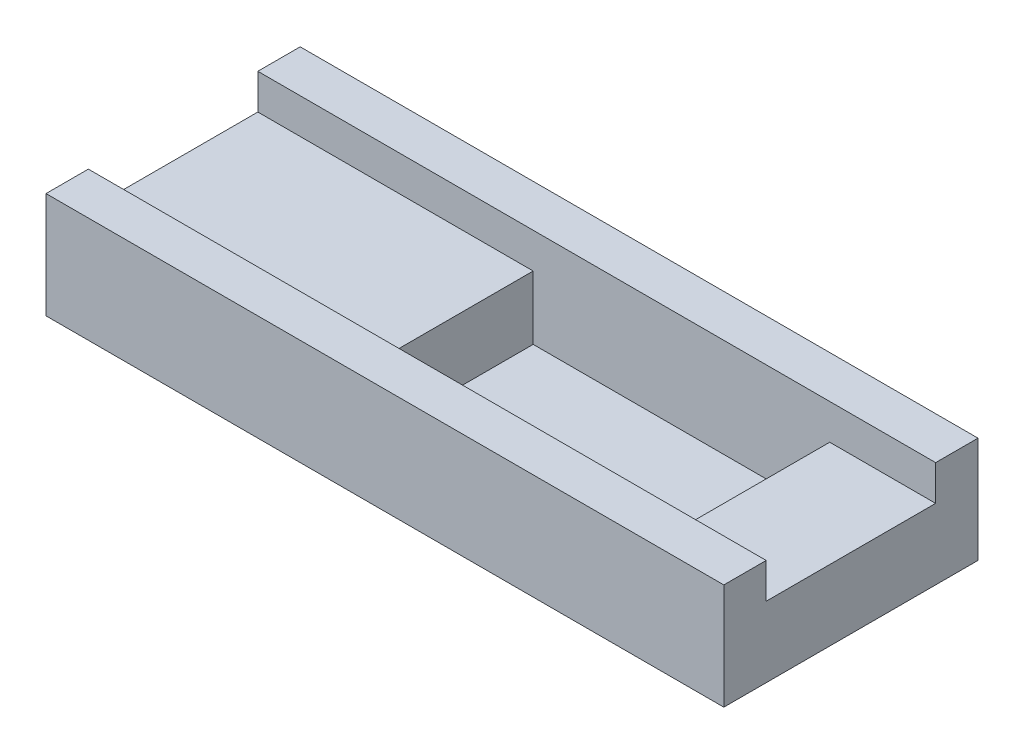
ISO-10303-21;
HEADER;
FILE_DESCRIPTION(('STEP AP214'),'2;1');
FILE_NAME('part.step','',(''),(''),'','','');
FILE_SCHEMA(('AUTOMOTIVE_DESIGN { 1 0 10303 214 1 1 1 1 }'));
ENDSEC;
DATA;
#1=APPLICATION_CONTEXT('core data for automotive mechanical design processes');
#2=APPLICATION_PROTOCOL_DEFINITION('international standard','automotive_design',2000,#1);
#3=PRODUCT_CONTEXT('',#1,'mechanical');
#4=PRODUCT('Part','Part','',(#3));
#5=PRODUCT_RELATED_PRODUCT_CATEGORY('part','',(#4));
#6=PRODUCT_DEFINITION_FORMATION('','',#4);
#7=PRODUCT_DEFINITION_CONTEXT('part definition',#1,'design');
#8=PRODUCT_DEFINITION('design','',#6,#7);
#9=PRODUCT_DEFINITION_SHAPE('','',#8);
#10=(LENGTH_UNIT() NAMED_UNIT(*) SI_UNIT(.MILLI.,.METRE.));
#11=(NAMED_UNIT(*) PLANE_ANGLE_UNIT() SI_UNIT($,.RADIAN.));
#12=(NAMED_UNIT(*) SI_UNIT($,.STERADIAN.) SOLID_ANGLE_UNIT());
#13=UNCERTAINTY_MEASURE_WITH_UNIT(LENGTH_MEASURE(1.E-05),#10,'distance_accuracy_value','');
#14=(GEOMETRIC_REPRESENTATION_CONTEXT(3) GLOBAL_UNCERTAINTY_ASSIGNED_CONTEXT((#13)) GLOBAL_UNIT_ASSIGNED_CONTEXT((#10,
#11,#12)) REPRESENTATION_CONTEXT('',''));
#15=CARTESIAN_POINT('',(0.,0.,0.));
#16=DIRECTION('',(0.,0.,1.));
#17=DIRECTION('',(1.,0.,0.));
#18=AXIS2_PLACEMENT_3D('',#15,#16,#17);
#19=CARTESIAN_POINT('',(0.,-5.,0.));
#20=DIRECTION('',(0.,-1.,0.));
#21=DIRECTION('',(0.,0.,-1.));
#22=AXIS2_PLACEMENT_3D('',#19,#20,#21);
#23=PLANE('',#22);
#24=DIRECTION('',(-1.,0.,0.));
#25=VECTOR('',#24,1.);
#26=CARTESIAN_POINT('',(0.,-5.,-12.));
#27=LINE('',#26,#25);
#28=CARTESIAN_POINT('',(96.,-5.,-12.));
#29=VERTEX_POINT('',#28);
#30=CARTESIAN_POINT('',(81.,-5.,-12.));
#31=VERTEX_POINT('',#30);
#32=EDGE_CURVE('E166',#29,#31,#27,.T.);
#33=ORIENTED_EDGE('',*,*,#32,.T.);
#34=DIRECTION('',(0.,0.,1.));
#35=VECTOR('',#34,1.);
#36=CARTESIAN_POINT('',(81.,-5.,0.));
#37=LINE('',#36,#35);
#38=CARTESIAN_POINT('',(81.,-5.,12.));
#39=VERTEX_POINT('',#38);
#40=EDGE_CURVE('E12',#31,#39,#37,.T.);
#41=ORIENTED_EDGE('',*,*,#40,.T.);
#42=DIRECTION('',(1.,0.,0.));
#43=VECTOR('',#42,1.);
#44=CARTESIAN_POINT('',(0.,-5.,12.));
#45=LINE('',#44,#43);
#46=CARTESIAN_POINT('',(96.,-5.,12.));
#47=VERTEX_POINT('',#46);
#48=EDGE_CURVE('E141',#39,#47,#45,.T.);
#49=ORIENTED_EDGE('',*,*,#48,.T.);
#50=DIRECTION('',(0.,0.,-1.));
#51=VECTOR('',#50,1.);
#52=CARTESIAN_POINT('',(96.,-5.,12.));
#53=LINE('',#52,#51);
#54=EDGE_CURVE('E163',#47,#29,#53,.T.);
#55=ORIENTED_EDGE('',*,*,#54,.T.);
#56=EDGE_LOOP('',(#33,#41,#49,#55));
#57=FACE_BOUND('',#56,.T.);
#58=ADVANCED_FACE('F36',(#57),#23,.F.);
#59=CARTESIAN_POINT('',(0.,0.,0.));
#60=DIRECTION('',(0.,-1.,0.));
#61=DIRECTION('',(0.,0.,-1.));
#62=AXIS2_PLACEMENT_3D('',#59,#60,#61);
#63=PLANE('',#62);
#64=DIRECTION('',(0.,0.,1.));
#65=VECTOR('',#64,1.);
#66=CARTESIAN_POINT('',(0.,0.,18.));
#67=LINE('',#66,#65);
#68=CARTESIAN_POINT('',(0.,0.,-18.));
#69=VERTEX_POINT('',#68);
#70=CARTESIAN_POINT('',(0.,0.,-12.));
#71=VERTEX_POINT('',#70);
#72=EDGE_CURVE('E195',#69,#71,#67,.T.);
#73=ORIENTED_EDGE('',*,*,#72,.T.);
#74=DIRECTION('',(-1.,0.,0.));
#75=VECTOR('',#74,1.);
#76=CARTESIAN_POINT('',(0.,0.,-12.));
#77=LINE('',#76,#75);
#78=CARTESIAN_POINT('',(96.,0.,-12.));
#79=VERTEX_POINT('',#78);
#80=EDGE_CURVE('E159',#79,#71,#77,.T.);
#81=ORIENTED_EDGE('',*,*,#80,.F.);
#82=DIRECTION('',(0.,0.,-1.));
#83=VECTOR('',#82,1.);
#84=CARTESIAN_POINT('',(96.,0.,18.));
#85=LINE('',#84,#83);
#86=CARTESIAN_POINT('',(96.,0.,-18.));
#87=VERTEX_POINT('',#86);
#88=EDGE_CURVE('E201',#79,#87,#85,.T.);
#89=ORIENTED_EDGE('',*,*,#88,.T.);
#90=DIRECTION('',(-1.,0.,0.));
#91=VECTOR('',#90,1.);
#92=CARTESIAN_POINT('',(0.,0.,-18.));
#93=LINE('',#92,#91);
#94=EDGE_CURVE('E185',#87,#69,#93,.T.);
#95=ORIENTED_EDGE('',*,*,#94,.T.);
#96=EDGE_LOOP('',(#73,#81,#89,#95));
#97=FACE_BOUND('',#96,.T.);
#98=ADVANCED_FACE('F238',(#97),#63,.F.);
#99=CARTESIAN_POINT('',(0.,-15.,18.));
#100=DIRECTION('',(-1.,0.,0.));
#101=DIRECTION('',(0.,0.,1.));
#102=AXIS2_PLACEMENT_3D('',#99,#100,#101);
#103=PLANE('',#102);
#104=DIRECTION('',(0.,1.,0.));
#105=VECTOR('',#104,1.);
#106=CARTESIAN_POINT('',(0.,-5.,-12.));
#107=LINE('',#106,#105);
#108=CARTESIAN_POINT('',(0.,-5.,-12.));
#109=VERTEX_POINT('',#108);
#110=EDGE_CURVE('E171',#109,#71,#107,.T.);
#111=ORIENTED_EDGE('',*,*,#110,.T.);
#112=ORIENTED_EDGE('',*,*,#72,.F.);
#113=DIRECTION('',(0.,1.,0.));
#114=VECTOR('',#113,1.);
#115=CARTESIAN_POINT('',(0.,-15.,-18.));
#116=LINE('',#115,#114);
#117=CARTESIAN_POINT('',(0.,-15.,-18.));
#118=VERTEX_POINT('',#117);
#119=EDGE_CURVE('E207',#118,#69,#116,.T.);
#120=ORIENTED_EDGE('',*,*,#119,.F.);
#121=DIRECTION('',(0.,0.,1.));
#122=VECTOR('',#121,1.);
#123=CARTESIAN_POINT('',(0.,-15.,18.));
#124=LINE('',#123,#122);
#125=CARTESIAN_POINT('',(0.,-15.,18.));
#126=VERTEX_POINT('',#125);
#127=EDGE_CURVE('E181',#118,#126,#124,.T.);
#128=ORIENTED_EDGE('',*,*,#127,.T.);
#129=DIRECTION('',(0.,1.,0.));
#130=VECTOR('',#129,1.);
#131=CARTESIAN_POINT('',(0.,-15.,18.));
#132=LINE('',#131,#130);
#133=CARTESIAN_POINT('',(0.,0.,18.));
#134=VERTEX_POINT('',#133);
#135=EDGE_CURVE('E194',#126,#134,#132,.T.);
#136=ORIENTED_EDGE('',*,*,#135,.T.);
#137=CARTESIAN_POINT('',(0.,0.,12.));
#138=VERTEX_POINT('',#137);
#139=EDGE_CURVE('E174',#138,#134,#67,.T.);
#140=ORIENTED_EDGE('',*,*,#139,.F.);
#141=DIRECTION('',(0.,1.,0.));
#142=VECTOR('',#141,1.);
#143=CARTESIAN_POINT('',(0.,-5.,12.));
#144=LINE('',#143,#142);
#145=CARTESIAN_POINT('',(0.,-5.,12.));
#146=VERTEX_POINT('',#145);
#147=EDGE_CURVE('E59',#146,#138,#144,.T.);
#148=ORIENTED_EDGE('',*,*,#147,.F.);
#149=DIRECTION('',(0.,0.,1.));
#150=VECTOR('',#149,1.);
#151=CARTESIAN_POINT('',(0.,-5.,12.));
#152=LINE('',#151,#150);
#153=EDGE_CURVE('E156',#109,#146,#152,.T.);
#154=ORIENTED_EDGE('',*,*,#153,.F.);
#155=EDGE_LOOP('',(#111,#112,#120,#128,#136,#140,#148,#154));
#156=FACE_BOUND('',#155,.T.);
#157=ADVANCED_FACE('F38',(#156),#103,.T.);
#158=CARTESIAN_POINT('',(0.,-15.,-18.));
#159=DIRECTION('',(0.,0.,-1.));
#160=DIRECTION('',(-1.,0.,0.));
#161=AXIS2_PLACEMENT_3D('',#158,#159,#160);
#162=PLANE('',#161);
#163=ORIENTED_EDGE('',*,*,#94,.F.);
#164=DIRECTION('',(0.,1.,0.));
#165=VECTOR('',#164,1.);
#166=CARTESIAN_POINT('',(96.,-15.,-18.));
#167=LINE('',#166,#165);
#168=CARTESIAN_POINT('',(96.,-15.,-18.));
#169=VERTEX_POINT('',#168);
#170=EDGE_CURVE('E209',#169,#87,#167,.T.);
#171=ORIENTED_EDGE('',*,*,#170,.F.);
#172=DIRECTION('',(-1.,0.,0.));
#173=VECTOR('',#172,1.);
#174=CARTESIAN_POINT('',(0.,-15.,-18.));
#175=LINE('',#174,#173);
#176=EDGE_CURVE('E191',#169,#118,#175,.T.);
#177=ORIENTED_EDGE('',*,*,#176,.T.);
#178=ORIENTED_EDGE('',*,*,#119,.T.);
#179=EDGE_LOOP('',(#163,#171,#177,#178));
#180=FACE_BOUND('',#179,.T.);
#181=ADVANCED_FACE('F243',(#180),#162,.T.);
#182=CARTESIAN_POINT('',(96.,-15.,18.));
#183=DIRECTION('',(1.,0.,0.));
#184=DIRECTION('',(0.,0.,-1.));
#185=AXIS2_PLACEMENT_3D('',#182,#183,#184);
#186=PLANE('',#185);
#187=DIRECTION('',(0.,1.,0.));
#188=VECTOR('',#187,1.);
#189=CARTESIAN_POINT('',(96.,-5.,-12.));
#190=LINE('',#189,#188);
#191=EDGE_CURVE('E175',#29,#79,#190,.T.);
#192=ORIENTED_EDGE('',*,*,#191,.F.);
#193=ORIENTED_EDGE('',*,*,#54,.F.);
#194=DIRECTION('',(0.,1.,0.));
#195=VECTOR('',#194,1.);
#196=CARTESIAN_POINT('',(96.,-5.,12.));
#197=LINE('',#196,#195);
#198=CARTESIAN_POINT('',(96.,0.,12.));
#199=VERTEX_POINT('',#198);
#200=EDGE_CURVE('E177',#47,#199,#197,.T.);
#201=ORIENTED_EDGE('',*,*,#200,.T.);
#202=CARTESIAN_POINT('',(96.,0.,18.));
#203=VERTEX_POINT('',#202);
#204=EDGE_CURVE('E202',#203,#199,#85,.T.);
#205=ORIENTED_EDGE('',*,*,#204,.F.);
#206=DIRECTION('',(0.,1.,0.));
#207=VECTOR('',#206,1.);
#208=CARTESIAN_POINT('',(96.,-15.,18.));
#209=LINE('',#208,#207);
#210=CARTESIAN_POINT('',(96.,-15.,18.));
#211=VERTEX_POINT('',#210);
#212=EDGE_CURVE('E212',#211,#203,#209,.T.);
#213=ORIENTED_EDGE('',*,*,#212,.F.);
#214=DIRECTION('',(0.,0.,-1.));
#215=VECTOR('',#214,1.);
#216=CARTESIAN_POINT('',(96.,-15.,18.));
#217=LINE('',#216,#215);
#218=EDGE_CURVE('E188',#211,#169,#217,.T.);
#219=ORIENTED_EDGE('',*,*,#218,.T.);
#220=ORIENTED_EDGE('',*,*,#170,.T.);
#221=ORIENTED_EDGE('',*,*,#88,.F.);
#222=EDGE_LOOP('',(#192,#193,#201,#205,#213,#219,#220,#221));
#223=FACE_BOUND('',#222,.T.);
#224=ADVANCED_FACE('F233',(#223),#186,.T.);
#225=CARTESIAN_POINT('',(0.,-15.,18.));
#226=DIRECTION('',(0.,0.,1.));
#227=DIRECTION('',(1.,0.,0.));
#228=AXIS2_PLACEMENT_3D('',#225,#226,#227);
#229=PLANE('',#228);
#230=DIRECTION('',(1.,0.,0.));
#231=VECTOR('',#230,1.);
#232=CARTESIAN_POINT('',(0.,0.,18.));
#233=LINE('',#232,#231);
#234=EDGE_CURVE('E198',#134,#203,#233,.T.);
#235=ORIENTED_EDGE('',*,*,#234,.F.);
#236=ORIENTED_EDGE('',*,*,#135,.F.);
#237=DIRECTION('',(1.,0.,0.));
#238=VECTOR('',#237,1.);
#239=CARTESIAN_POINT('',(0.,-15.,18.));
#240=LINE('',#239,#238);
#241=EDGE_CURVE('E184',#126,#211,#240,.T.);
#242=ORIENTED_EDGE('',*,*,#241,.T.);
#243=ORIENTED_EDGE('',*,*,#212,.T.);
#244=EDGE_LOOP('',(#235,#236,#242,#243));
#245=FACE_BOUND('',#244,.T.);
#246=ADVANCED_FACE('F249',(#245),#229,.T.);
#247=CARTESIAN_POINT('',(0.,-15.,0.));
#248=DIRECTION('',(0.,-1.,0.));
#249=DIRECTION('',(0.,0.,-1.));
#250=AXIS2_PLACEMENT_3D('',#247,#248,#249);
#251=PLANE('',#250);
#252=ORIENTED_EDGE('',*,*,#127,.F.);
#253=ORIENTED_EDGE('',*,*,#176,.F.);
#254=ORIENTED_EDGE('',*,*,#218,.F.);
#255=ORIENTED_EDGE('',*,*,#241,.F.);
#256=EDGE_LOOP('',(#252,#253,#254,#255));
#257=FACE_BOUND('',#256,.T.);
#258=ADVANCED_FACE('F247',(#257),#251,.T.);
#259=ORIENTED_EDGE('',*,*,#204,.T.);
#260=DIRECTION('',(1.,0.,0.));
#261=VECTOR('',#260,1.);
#262=CARTESIAN_POINT('',(0.,0.,12.));
#263=LINE('',#262,#261);
#264=EDGE_CURVE('E155',#138,#199,#263,.T.);
#265=ORIENTED_EDGE('',*,*,#264,.F.);
#266=ORIENTED_EDGE('',*,*,#139,.T.);
#267=ORIENTED_EDGE('',*,*,#234,.T.);
#268=EDGE_LOOP('',(#259,#265,#266,#267));
#269=FACE_BOUND('',#268,.T.);
#270=ADVANCED_FACE('F228',(#269),#63,.F.);
#271=CARTESIAN_POINT('',(0.,-5.,-12.));
#272=DIRECTION('',(0.,0.,-1.));
#273=DIRECTION('',(-1.,0.,0.));
#274=AXIS2_PLACEMENT_3D('',#271,#272,#273);
#275=PLANE('',#274);
#276=CARTESIAN_POINT('',(39.,-5.,-12.));
#277=VERTEX_POINT('',#276);
#278=EDGE_CURVE('E165',#277,#109,#27,.T.);
#279=ORIENTED_EDGE('',*,*,#278,.F.);
#280=DIRECTION('',(0.,1.,0.));
#281=VECTOR('',#280,1.);
#282=CARTESIAN_POINT('',(39.,-63.3735464897913,-12.));
#283=LINE('',#282,#281);
#284=CARTESIAN_POINT('',(39.,-14.,-12.));
#285=VERTEX_POINT('',#284);
#286=EDGE_CURVE('E51',#285,#277,#283,.T.);
#287=ORIENTED_EDGE('',*,*,#286,.F.);
#288=DIRECTION('',(-1.,0.,0.));
#289=VECTOR('',#288,1.);
#290=CARTESIAN_POINT('',(39.,-14.,-12.));
#291=LINE('',#290,#289);
#292=CARTESIAN_POINT('',(81.,-14.,-12.));
#293=VERTEX_POINT('',#292);
#294=EDGE_CURVE('E150',#293,#285,#291,.T.);
#295=ORIENTED_EDGE('',*,*,#294,.F.);
#296=DIRECTION('',(0.,1.,0.));
#297=VECTOR('',#296,1.);
#298=CARTESIAN_POINT('',(81.,-63.3735464897913,-12.));
#299=LINE('',#298,#297);
#300=EDGE_CURVE('E130',#293,#31,#299,.T.);
#301=ORIENTED_EDGE('',*,*,#300,.T.);
#302=ORIENTED_EDGE('',*,*,#32,.F.);
#303=ORIENTED_EDGE('',*,*,#191,.T.);
#304=ORIENTED_EDGE('',*,*,#80,.T.);
#305=ORIENTED_EDGE('',*,*,#110,.F.);
#306=EDGE_LOOP('',(#279,#287,#295,#301,#302,#303,#304,#305));
#307=FACE_BOUND('',#306,.T.);
#308=ADVANCED_FACE('F220',(#307),#275,.F.);
#309=CARTESIAN_POINT('',(0.,-5.,12.));
#310=DIRECTION('',(0.,0.,1.));
#311=DIRECTION('',(1.,0.,0.));
#312=AXIS2_PLACEMENT_3D('',#309,#310,#311);
#313=PLANE('',#312);
#314=ORIENTED_EDGE('',*,*,#264,.T.);
#315=ORIENTED_EDGE('',*,*,#200,.F.);
#316=ORIENTED_EDGE('',*,*,#48,.F.);
#317=DIRECTION('',(0.,1.,0.));
#318=VECTOR('',#317,1.);
#319=CARTESIAN_POINT('',(81.,-63.3735464897913,12.));
#320=LINE('',#319,#318);
#321=CARTESIAN_POINT('',(81.,-14.,12.));
#322=VERTEX_POINT('',#321);
#323=EDGE_CURVE('E128',#322,#39,#320,.T.);
#324=ORIENTED_EDGE('',*,*,#323,.F.);
#325=DIRECTION('',(1.,0.,0.));
#326=VECTOR('',#325,1.);
#327=CARTESIAN_POINT('',(39.,-14.,12.));
#328=LINE('',#327,#326);
#329=CARTESIAN_POINT('',(39.,-14.,12.));
#330=VERTEX_POINT('',#329);
#331=EDGE_CURVE('E138',#330,#322,#328,.T.);
#332=ORIENTED_EDGE('',*,*,#331,.F.);
#333=DIRECTION('',(0.,1.,0.));
#334=VECTOR('',#333,1.);
#335=CARTESIAN_POINT('',(39.,-63.3735464897913,12.));
#336=LINE('',#335,#334);
#337=CARTESIAN_POINT('',(39.,-5.,12.));
#338=VERTEX_POINT('',#337);
#339=EDGE_CURVE('E149',#330,#338,#336,.T.);
#340=ORIENTED_EDGE('',*,*,#339,.T.);
#341=EDGE_CURVE('E160',#146,#338,#45,.T.);
#342=ORIENTED_EDGE('',*,*,#341,.F.);
#343=ORIENTED_EDGE('',*,*,#147,.T.);
#344=EDGE_LOOP('',(#314,#315,#316,#324,#332,#340,#342,#343));
#345=FACE_BOUND('',#344,.T.);
#346=ADVANCED_FACE('F136',(#345),#313,.F.);
#347=ORIENTED_EDGE('',*,*,#341,.T.);
#348=DIRECTION('',(0.,0.,-1.));
#349=VECTOR('',#348,1.);
#350=CARTESIAN_POINT('',(39.,-5.,0.));
#351=LINE('',#350,#349);
#352=EDGE_CURVE('E44',#338,#277,#351,.T.);
#353=ORIENTED_EDGE('',*,*,#352,.T.);
#354=ORIENTED_EDGE('',*,*,#278,.T.);
#355=ORIENTED_EDGE('',*,*,#153,.T.);
#356=EDGE_LOOP('',(#347,#353,#354,#355));
#357=FACE_BOUND('',#356,.T.);
#358=ADVANCED_FACE('F217',(#357),#23,.F.);
#359=CARTESIAN_POINT('',(81.,-63.3735464897913,12.));
#360=DIRECTION('',(1.,0.,0.));
#361=DIRECTION('',(0.,0.,-1.));
#362=AXIS2_PLACEMENT_3D('',#359,#360,#361);
#363=PLANE('',#362);
#364=ORIENTED_EDGE('',*,*,#300,.F.);
#365=DIRECTION('',(0.,0.,-1.));
#366=VECTOR('',#365,1.);
#367=CARTESIAN_POINT('',(81.,-14.,12.));
#368=LINE('',#367,#366);
#369=EDGE_CURVE('E125',#322,#293,#368,.T.);
#370=ORIENTED_EDGE('',*,*,#369,.F.);
#371=ORIENTED_EDGE('',*,*,#323,.T.);
#372=ORIENTED_EDGE('',*,*,#40,.F.);
#373=EDGE_LOOP('',(#364,#370,#371,#372));
#374=FACE_BOUND('',#373,.T.);
#375=ADVANCED_FACE('F127',(#374),#363,.F.);
#376=CARTESIAN_POINT('',(39.,-63.3735464897913,12.));
#377=DIRECTION('',(-1.,0.,0.));
#378=DIRECTION('',(0.,0.,1.));
#379=AXIS2_PLACEMENT_3D('',#376,#377,#378);
#380=PLANE('',#379);
#381=ORIENTED_EDGE('',*,*,#339,.F.);
#382=DIRECTION('',(0.,0.,1.));
#383=VECTOR('',#382,1.);
#384=CARTESIAN_POINT('',(39.,-14.,12.));
#385=LINE('',#384,#383);
#386=EDGE_CURVE('E144',#285,#330,#385,.T.);
#387=ORIENTED_EDGE('',*,*,#386,.F.);
#388=ORIENTED_EDGE('',*,*,#286,.T.);
#389=ORIENTED_EDGE('',*,*,#352,.F.);
#390=EDGE_LOOP('',(#381,#387,#388,#389));
#391=FACE_BOUND('',#390,.T.);
#392=ADVANCED_FACE('F270',(#391),#380,.F.);
#393=CARTESIAN_POINT('',(0.,-14.,0.));
#394=DIRECTION('',(0.,-1.,0.));
#395=DIRECTION('',(0.,0.,-1.));
#396=AXIS2_PLACEMENT_3D('',#393,#394,#395);
#397=PLANE('',#396);
#398=ORIENTED_EDGE('',*,*,#386,.T.);
#399=ORIENTED_EDGE('',*,*,#331,.T.);
#400=ORIENTED_EDGE('',*,*,#369,.T.);
#401=ORIENTED_EDGE('',*,*,#294,.T.);
#402=EDGE_LOOP('',(#398,#399,#400,#401));
#403=FACE_BOUND('',#402,.T.);
#404=ADVANCED_FACE('F143',(#403),#397,.F.);
#405=CLOSED_SHELL('',(#58,#98,#157,#181,#224,#246,#258,#270,#308,#346,#358,#375,#392,#404));
#406=MANIFOLD_SOLID_BREP('B2',#405);
#407=ADVANCED_BREP_SHAPE_REPRESENTATION('',(#18,#406),#14);
#408=SHAPE_DEFINITION_REPRESENTATION(#9,#407);
ENDSEC;
END-ISO-10303-21;
